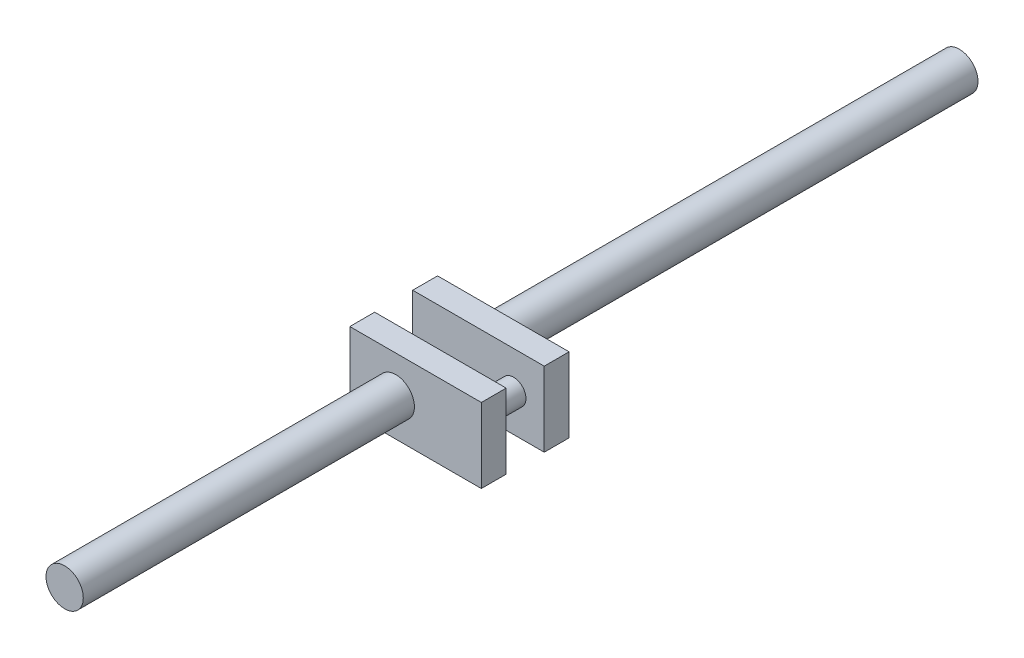
ISO-10303-21;
HEADER;
FILE_DESCRIPTION(('STEP AP214'),'2;1');
FILE_NAME('part.step','',(''),(''),'','','');
FILE_SCHEMA(('AUTOMOTIVE_DESIGN { 1 0 10303 214 1 1 1 1 }'));
ENDSEC;
DATA;
#1=APPLICATION_CONTEXT('core data for automotive mechanical design processes');
#2=APPLICATION_PROTOCOL_DEFINITION('international standard','automotive_design',2000,#1);
#3=PRODUCT_CONTEXT('',#1,'mechanical');
#4=PRODUCT('Part','Part','',(#3));
#5=PRODUCT_RELATED_PRODUCT_CATEGORY('part','',(#4));
#6=PRODUCT_DEFINITION_FORMATION('','',#4);
#7=PRODUCT_DEFINITION_CONTEXT('part definition',#1,'design');
#8=PRODUCT_DEFINITION('design','',#6,#7);
#9=PRODUCT_DEFINITION_SHAPE('','',#8);
#10=(LENGTH_UNIT() NAMED_UNIT(*) SI_UNIT(.MILLI.,.METRE.));
#11=(NAMED_UNIT(*) PLANE_ANGLE_UNIT() SI_UNIT($,.RADIAN.));
#12=(NAMED_UNIT(*) SI_UNIT($,.STERADIAN.) SOLID_ANGLE_UNIT());
#13=UNCERTAINTY_MEASURE_WITH_UNIT(LENGTH_MEASURE(1.E-05),#10,'distance_accuracy_value','');
#14=(GEOMETRIC_REPRESENTATION_CONTEXT(3) GLOBAL_UNCERTAINTY_ASSIGNED_CONTEXT((#13)) GLOBAL_UNIT_ASSIGNED_CONTEXT((#10,
#11,#12)) REPRESENTATION_CONTEXT('',''));
#15=CARTESIAN_POINT('',(0.,0.,0.));
#16=DIRECTION('',(0.,0.,1.));
#17=DIRECTION('',(1.,0.,0.));
#18=AXIS2_PLACEMENT_3D('',#15,#16,#17);
#19=CARTESIAN_POINT('',(22.0784487209815,0.,46.4578179555906));
#20=DIRECTION('',(0.,0.,-1.));
#21=DIRECTION('',(-1.,0.,0.));
#22=AXIS2_PLACEMENT_3D('',#19,#20,#21);
#23=CYLINDRICAL_SURFACE('',#22,5.);
#24=CARTESIAN_POINT('',(22.0784487209815,0.,21.4578179555906));
#25=DIRECTION('',(0.,0.,-1.));
#26=DIRECTION('',(-1.,0.,0.));
#27=AXIS2_PLACEMENT_3D('',#24,#25,#26);
#28=CIRCLE('',#27,5.);
#29=CARTESIAN_POINT('',(17.0784487209815,0.,21.4578179555906));
#30=VERTEX_POINT('',#29);
#31=EDGE_CURVE('E53',#30,#30,#28,.F.);
#32=ORIENTED_EDGE('',*,*,#31,.T.);
#33=EDGE_LOOP('',(#32));
#34=FACE_BOUND('',#33,.T.);
#35=CARTESIAN_POINT('',(22.0784487209815,0.,36.7628049111488));
#36=DIRECTION('',(0.,0.,1.));
#37=DIRECTION('',(1.,0.,0.));
#38=AXIS2_PLACEMENT_3D('',#35,#36,#37);
#39=CIRCLE('',#38,5.);
#40=CARTESIAN_POINT('',(27.0784487209815,0.,36.7628049111488));
#41=VERTEX_POINT('',#40);
#42=EDGE_CURVE('E11',#41,#41,#39,.T.);
#43=ORIENTED_EDGE('',*,*,#42,.F.);
#44=EDGE_LOOP('',(#43));
#45=FACE_BOUND('',#44,.T.);
#46=ADVANCED_FACE('F43',(#34,#45),#23,.T.);
#47=CARTESIAN_POINT('',(-18.4915133638617,15.,21.4578179555906));
#48=DIRECTION('',(0.,0.,-1.));
#49=DIRECTION('',(-1.,0.,0.));
#50=AXIS2_PLACEMENT_3D('',#47,#48,#49);
#51=PLANE('',#50);
#52=ORIENTED_EDGE('',*,*,#31,.F.);
#53=EDGE_LOOP('',(#52));
#54=FACE_BOUND('',#53,.T.);
#55=DIRECTION('',(1.,0.,0.));
#56=VECTOR('',#55,1.);
#57=CARTESIAN_POINT('',(-18.4915133638617,-15.,21.4578179555906));
#58=LINE('',#57,#56);
#59=CARTESIAN_POINT('',(-18.4915133638617,-15.,21.4578179555906));
#60=VERTEX_POINT('',#59);
#61=CARTESIAN_POINT('',(34.4268925602896,-15.,21.4578179555906));
#62=VERTEX_POINT('',#61);
#63=EDGE_CURVE('E178',#60,#62,#58,.T.);
#64=ORIENTED_EDGE('',*,*,#63,.T.);
#65=DIRECTION('',(0.,-1.,0.));
#66=VECTOR('',#65,1.);
#67=CARTESIAN_POINT('',(34.4268925602896,15.,21.4578179555906));
#68=LINE('',#67,#66);
#69=CARTESIAN_POINT('',(34.4268925602896,15.,21.4578179555906));
#70=VERTEX_POINT('',#69);
#71=EDGE_CURVE('E213',#70,#62,#68,.T.);
#72=ORIENTED_EDGE('',*,*,#71,.F.);
#73=DIRECTION('',(1.,0.,0.));
#74=VECTOR('',#73,1.);
#75=CARTESIAN_POINT('',(-18.4915133638617,15.,21.4578179555906));
#76=LINE('',#75,#74);
#77=CARTESIAN_POINT('',(-18.4915133638617,15.,21.4578179555906));
#78=VERTEX_POINT('',#77);
#79=EDGE_CURVE('E87',#78,#70,#76,.T.);
#80=ORIENTED_EDGE('',*,*,#79,.F.);
#81=DIRECTION('',(0.,-1.,0.));
#82=VECTOR('',#81,1.);
#83=CARTESIAN_POINT('',(-18.4915133638617,15.,21.4578179555906));
#84=LINE('',#83,#82);
#85=EDGE_CURVE('E61',#78,#60,#84,.T.);
#86=ORIENTED_EDGE('',*,*,#85,.T.);
#87=EDGE_LOOP('',(#64,#72,#80,#86));
#88=FACE_BOUND('',#87,.T.);
#89=ADVANCED_FACE('F229',(#54,#88),#51,.F.);
#90=CARTESIAN_POINT('',(34.4268925602896,15.,11.4578179555906));
#91=DIRECTION('',(1.,0.,0.));
#92=DIRECTION('',(0.,0.,-1.));
#93=AXIS2_PLACEMENT_3D('',#90,#91,#92);
#94=PLANE('',#93);
#95=DIRECTION('',(0.,0.,1.));
#96=VECTOR('',#95,1.);
#97=CARTESIAN_POINT('',(34.4268925602896,-15.,11.4578179555906));
#98=LINE('',#97,#96);
#99=CARTESIAN_POINT('',(34.4268925602896,-15.,11.4578179555906));
#100=VERTEX_POINT('',#99);
#101=EDGE_CURVE('E195',#100,#62,#98,.T.);
#102=ORIENTED_EDGE('',*,*,#101,.F.);
#103=DIRECTION('',(0.,-1.,0.));
#104=VECTOR('',#103,1.);
#105=CARTESIAN_POINT('',(34.4268925602896,15.,11.4578179555906));
#106=LINE('',#105,#104);
#107=CARTESIAN_POINT('',(34.4268925602896,15.,11.4578179555906));
#108=VERTEX_POINT('',#107);
#109=EDGE_CURVE('E210',#108,#100,#106,.T.);
#110=ORIENTED_EDGE('',*,*,#109,.F.);
#111=DIRECTION('',(0.,0.,1.));
#112=VECTOR('',#111,1.);
#113=CARTESIAN_POINT('',(34.4268925602896,15.,11.4578179555906));
#114=LINE('',#113,#112);
#115=EDGE_CURVE('E181',#108,#70,#114,.T.);
#116=ORIENTED_EDGE('',*,*,#115,.T.);
#117=ORIENTED_EDGE('',*,*,#71,.T.);
#118=EDGE_LOOP('',(#102,#110,#116,#117));
#119=FACE_BOUND('',#118,.T.);
#120=ADVANCED_FACE('F231',(#119),#94,.T.);
#121=CARTESIAN_POINT('',(-18.4915133638617,15.,11.4578179555906));
#122=DIRECTION('',(0.,0.,-1.));
#123=DIRECTION('',(-1.,0.,0.));
#124=AXIS2_PLACEMENT_3D('',#121,#122,#123);
#125=PLANE('',#124);
#126=CARTESIAN_POINT('',(0.,0.,11.4578179555906));
#127=DIRECTION('',(0.,0.,-1.));
#128=DIRECTION('',(-1.,0.,0.));
#129=AXIS2_PLACEMENT_3D('',#126,#127,#128);
#130=CIRCLE('',#129,7.5);
#131=CARTESIAN_POINT('',(-7.5,0.,11.4578179555906));
#132=VERTEX_POINT('',#131);
#133=EDGE_CURVE('E216',#132,#132,#130,.T.);
#134=ORIENTED_EDGE('',*,*,#133,.F.);
#135=EDGE_LOOP('',(#134));
#136=FACE_BOUND('',#135,.T.);
#137=DIRECTION('',(1.,0.,0.));
#138=VECTOR('',#137,1.);
#139=CARTESIAN_POINT('',(-18.4915133638617,-15.,11.4578179555906));
#140=LINE('',#139,#138);
#141=CARTESIAN_POINT('',(-18.4915133638617,-15.,11.4578179555906));
#142=VERTEX_POINT('',#141);
#143=EDGE_CURVE('E199',#142,#100,#140,.T.);
#144=ORIENTED_EDGE('',*,*,#143,.F.);
#145=DIRECTION('',(0.,-1.,0.));
#146=VECTOR('',#145,1.);
#147=CARTESIAN_POINT('',(-18.4915133638617,15.,11.4578179555906));
#148=LINE('',#147,#146);
#149=CARTESIAN_POINT('',(-18.4915133638617,15.,11.4578179555906));
#150=VERTEX_POINT('',#149);
#151=EDGE_CURVE('E76',#150,#142,#148,.T.);
#152=ORIENTED_EDGE('',*,*,#151,.F.);
#153=DIRECTION('',(1.,0.,0.));
#154=VECTOR('',#153,1.);
#155=CARTESIAN_POINT('',(-18.4915133638617,15.,11.4578179555906));
#156=LINE('',#155,#154);
#157=EDGE_CURVE('E186',#150,#108,#156,.T.);
#158=ORIENTED_EDGE('',*,*,#157,.T.);
#159=ORIENTED_EDGE('',*,*,#109,.T.);
#160=EDGE_LOOP('',(#144,#152,#158,#159));
#161=FACE_BOUND('',#160,.T.);
#162=ADVANCED_FACE('F240',(#136,#161),#125,.T.);
#163=CARTESIAN_POINT('',(-18.4915133638617,15.,21.4578179555906));
#164=DIRECTION('',(-1.,0.,0.));
#165=DIRECTION('',(0.,0.,1.));
#166=AXIS2_PLACEMENT_3D('',#163,#164,#165);
#167=PLANE('',#166);
#168=DIRECTION('',(0.,0.,-1.));
#169=VECTOR('',#168,1.);
#170=CARTESIAN_POINT('',(-18.4915133638617,-15.,21.4578179555906));
#171=LINE('',#170,#169);
#172=EDGE_CURVE('E182',#60,#142,#171,.T.);
#173=ORIENTED_EDGE('',*,*,#172,.F.);
#174=ORIENTED_EDGE('',*,*,#85,.F.);
#175=DIRECTION('',(0.,0.,-1.));
#176=VECTOR('',#175,1.);
#177=CARTESIAN_POINT('',(-18.4915133638617,15.,21.4578179555906));
#178=LINE('',#177,#176);
#179=EDGE_CURVE('E190',#78,#150,#178,.T.);
#180=ORIENTED_EDGE('',*,*,#179,.T.);
#181=ORIENTED_EDGE('',*,*,#151,.T.);
#182=EDGE_LOOP('',(#173,#174,#180,#181));
#183=FACE_BOUND('',#182,.T.);
#184=ADVANCED_FACE('F241',(#183),#167,.T.);
#185=CARTESIAN_POINT('',(0.,15.,0.));
#186=DIRECTION('',(0.,-1.,0.));
#187=DIRECTION('',(-1.,0.,0.));
#188=AXIS2_PLACEMENT_3D('',#185,#186,#187);
#189=PLANE('',#188);
#190=ORIENTED_EDGE('',*,*,#79,.T.);
#191=ORIENTED_EDGE('',*,*,#115,.F.);
#192=ORIENTED_EDGE('',*,*,#157,.F.);
#193=ORIENTED_EDGE('',*,*,#179,.F.);
#194=EDGE_LOOP('',(#190,#191,#192,#193));
#195=FACE_BOUND('',#194,.T.);
#196=ADVANCED_FACE('F238',(#195),#189,.F.);
#197=CARTESIAN_POINT('',(0.,-15.,0.));
#198=DIRECTION('',(0.,-1.,0.));
#199=DIRECTION('',(-1.,0.,0.));
#200=AXIS2_PLACEMENT_3D('',#197,#198,#199);
#201=PLANE('',#200);
#202=ORIENTED_EDGE('',*,*,#63,.F.);
#203=ORIENTED_EDGE('',*,*,#172,.T.);
#204=ORIENTED_EDGE('',*,*,#143,.T.);
#205=ORIENTED_EDGE('',*,*,#101,.T.);
#206=EDGE_LOOP('',(#202,#203,#204,#205));
#207=FACE_BOUND('',#206,.T.);
#208=ADVANCED_FACE('F235',(#207),#201,.T.);
#209=CARTESIAN_POINT('',(0.,0.,180.));
#210=DIRECTION('',(0.,0.,-1.));
#211=DIRECTION('',(-1.,0.,0.));
#212=AXIS2_PLACEMENT_3D('',#209,#210,#211);
#213=CYLINDRICAL_SURFACE('',#212,7.5);
#214=ORIENTED_EDGE('',*,*,#133,.T.);
#215=EDGE_LOOP('',(#214));
#216=FACE_BOUND('',#215,.T.);
#217=CARTESIAN_POINT('',(0.,0.,-180.));
#218=DIRECTION('',(0.,0.,1.));
#219=DIRECTION('',(1.,0.,0.));
#220=AXIS2_PLACEMENT_3D('',#217,#218,#219);
#221=CIRCLE('',#220,7.5);
#222=CARTESIAN_POINT('',(7.5,0.,-180.));
#223=VERTEX_POINT('',#222);
#224=EDGE_CURVE('E217',#223,#223,#221,.T.);
#225=ORIENTED_EDGE('',*,*,#224,.T.);
#226=EDGE_LOOP('',(#225));
#227=FACE_BOUND('',#226,.T.);
#228=ADVANCED_FACE('F45',(#216,#227),#213,.T.);
#229=CARTESIAN_POINT('',(0.,0.,-180.));
#230=DIRECTION('',(0.,0.,1.));
#231=DIRECTION('',(1.,0.,0.));
#232=AXIS2_PLACEMENT_3D('',#229,#230,#231);
#233=PLANE('',#232);
#234=ORIENTED_EDGE('',*,*,#224,.F.);
#235=EDGE_LOOP('',(#234));
#236=FACE_BOUND('',#235,.T.);
#237=ADVANCED_FACE('F263',(#236),#233,.F.);
#238=CARTESIAN_POINT('',(0.,0.,180.));
#239=DIRECTION('',(0.,0.,-1.));
#240=DIRECTION('',(-1.,0.,0.));
#241=AXIS2_PLACEMENT_3D('',#238,#239,#240);
#242=CYLINDRICAL_SURFACE('',#241,7.5);
#243=CARTESIAN_POINT('',(0.,0.,180.));
#244=DIRECTION('',(0.,0.,1.));
#245=DIRECTION('',(1.,0.,0.));
#246=AXIS2_PLACEMENT_3D('',#243,#244,#245);
#247=CIRCLE('',#246,7.5);
#248=CARTESIAN_POINT('',(7.5,0.,180.));
#249=VERTEX_POINT('',#248);
#250=EDGE_CURVE('E139',#249,#249,#247,.T.);
#251=ORIENTED_EDGE('',*,*,#250,.F.);
#252=EDGE_LOOP('',(#251));
#253=FACE_BOUND('',#252,.T.);
#254=CARTESIAN_POINT('',(0.,0.,46.7628049111489));
#255=DIRECTION('',(0.,0.,-1.));
#256=DIRECTION('',(-1.,0.,0.));
#257=AXIS2_PLACEMENT_3D('',#254,#255,#256);
#258=CIRCLE('',#257,7.5);
#259=CARTESIAN_POINT('',(-7.5,0.,46.7628049111489));
#260=VERTEX_POINT('',#259);
#261=EDGE_CURVE('E174',#260,#260,#258,.T.);
#262=ORIENTED_EDGE('',*,*,#261,.F.);
#263=EDGE_LOOP('',(#262));
#264=FACE_BOUND('',#263,.T.);
#265=ADVANCED_FACE('F257',(#253,#264),#242,.T.);
#266=CARTESIAN_POINT('',(0.,0.,180.));
#267=DIRECTION('',(0.,0.,1.));
#268=DIRECTION('',(1.,0.,0.));
#269=AXIS2_PLACEMENT_3D('',#266,#267,#268);
#270=PLANE('',#269);
#271=ORIENTED_EDGE('',*,*,#250,.T.);
#272=EDGE_LOOP('',(#271));
#273=FACE_BOUND('',#272,.T.);
#274=ADVANCED_FACE('F275',(#273),#270,.T.);
#275=CARTESIAN_POINT('',(-18.4915133638617,15.,46.7628049111489));
#276=DIRECTION('',(0.,0.,-1.));
#277=DIRECTION('',(-1.,0.,0.));
#278=AXIS2_PLACEMENT_3D('',#275,#276,#277);
#279=PLANE('',#278);
#280=ORIENTED_EDGE('',*,*,#261,.T.);
#281=EDGE_LOOP('',(#280));
#282=FACE_BOUND('',#281,.T.);
#283=DIRECTION('',(1.,0.,0.));
#284=VECTOR('',#283,1.);
#285=CARTESIAN_POINT('',(-18.4915133638617,-15.,46.7628049111489));
#286=LINE('',#285,#284);
#287=CARTESIAN_POINT('',(-18.4915133638617,-15.,46.7628049111489));
#288=VERTEX_POINT('',#287);
#289=CARTESIAN_POINT('',(34.4268925602896,-15.,46.7628049111489));
#290=VERTEX_POINT('',#289);
#291=EDGE_CURVE('E134',#288,#290,#286,.T.);
#292=ORIENTED_EDGE('',*,*,#291,.T.);
#293=DIRECTION('',(0.,-1.,0.));
#294=VECTOR('',#293,1.);
#295=CARTESIAN_POINT('',(34.4268925602896,15.,46.7628049111489));
#296=LINE('',#295,#294);
#297=CARTESIAN_POINT('',(34.4268925602896,15.,46.7628049111489));
#298=VERTEX_POINT('',#297);
#299=EDGE_CURVE('E131',#298,#290,#296,.T.);
#300=ORIENTED_EDGE('',*,*,#299,.F.);
#301=DIRECTION('',(1.,0.,0.));
#302=VECTOR('',#301,1.);
#303=CARTESIAN_POINT('',(-18.4915133638617,15.,46.7628049111489));
#304=LINE('',#303,#302);
#305=CARTESIAN_POINT('',(-18.4915133638617,15.,46.7628049111489));
#306=VERTEX_POINT('',#305);
#307=EDGE_CURVE('E117',#306,#298,#304,.T.);
#308=ORIENTED_EDGE('',*,*,#307,.F.);
#309=DIRECTION('',(0.,-1.,0.));
#310=VECTOR('',#309,1.);
#311=CARTESIAN_POINT('',(-18.4915133638617,15.,46.7628049111489));
#312=LINE('',#311,#310);
#313=EDGE_CURVE('E151',#306,#288,#312,.T.);
#314=ORIENTED_EDGE('',*,*,#313,.T.);
#315=EDGE_LOOP('',(#292,#300,#308,#314));
#316=FACE_BOUND('',#315,.T.);
#317=ADVANCED_FACE('F132',(#282,#316),#279,.F.);
#318=CARTESIAN_POINT('',(34.4268925602896,15.,36.7628049111489));
#319=DIRECTION('',(1.,0.,0.));
#320=DIRECTION('',(0.,0.,-1.));
#321=AXIS2_PLACEMENT_3D('',#318,#319,#320);
#322=PLANE('',#321);
#323=DIRECTION('',(0.,0.,1.));
#324=VECTOR('',#323,1.);
#325=CARTESIAN_POINT('',(34.4268925602896,-15.,36.7628049111489));
#326=LINE('',#325,#324);
#327=CARTESIAN_POINT('',(34.4268925602896,-15.,36.7628049111489));
#328=VERTEX_POINT('',#327);
#329=EDGE_CURVE('E154',#328,#290,#326,.T.);
#330=ORIENTED_EDGE('',*,*,#329,.F.);
#331=DIRECTION('',(0.,-1.,0.));
#332=VECTOR('',#331,1.);
#333=CARTESIAN_POINT('',(34.4268925602896,15.,36.7628049111489));
#334=LINE('',#333,#332);
#335=CARTESIAN_POINT('',(34.4268925602896,15.,36.7628049111489));
#336=VERTEX_POINT('',#335);
#337=EDGE_CURVE('E140',#336,#328,#334,.T.);
#338=ORIENTED_EDGE('',*,*,#337,.F.);
#339=DIRECTION('',(0.,0.,1.));
#340=VECTOR('',#339,1.);
#341=CARTESIAN_POINT('',(34.4268925602896,15.,36.7628049111489));
#342=LINE('',#341,#340);
#343=EDGE_CURVE('E122',#336,#298,#342,.T.);
#344=ORIENTED_EDGE('',*,*,#343,.T.);
#345=ORIENTED_EDGE('',*,*,#299,.T.);
#346=EDGE_LOOP('',(#330,#338,#344,#345));
#347=FACE_BOUND('',#346,.T.);
#348=ADVANCED_FACE('F142',(#347),#322,.T.);
#349=CARTESIAN_POINT('',(-18.4915133638617,15.,46.7628049111489));
#350=DIRECTION('',(-1.,0.,0.));
#351=DIRECTION('',(0.,0.,1.));
#352=AXIS2_PLACEMENT_3D('',#349,#350,#351);
#353=PLANE('',#352);
#354=DIRECTION('',(0.,0.,-1.));
#355=VECTOR('',#354,1.);
#356=CARTESIAN_POINT('',(-18.4915133638617,-15.,46.7628049111489));
#357=LINE('',#356,#355);
#358=CARTESIAN_POINT('',(-18.4915133638617,-15.,36.7628049111489));
#359=VERTEX_POINT('',#358);
#360=EDGE_CURVE('E128',#288,#359,#357,.T.);
#361=ORIENTED_EDGE('',*,*,#360,.F.);
#362=ORIENTED_EDGE('',*,*,#313,.F.);
#363=DIRECTION('',(0.,0.,-1.));
#364=VECTOR('',#363,1.);
#365=CARTESIAN_POINT('',(-18.4915133638617,15.,46.7628049111489));
#366=LINE('',#365,#364);
#367=CARTESIAN_POINT('',(-18.4915133638617,15.,36.7628049111489));
#368=VERTEX_POINT('',#367);
#369=EDGE_CURVE('E125',#306,#368,#366,.T.);
#370=ORIENTED_EDGE('',*,*,#369,.T.);
#371=DIRECTION('',(0.,-1.,0.));
#372=VECTOR('',#371,1.);
#373=CARTESIAN_POINT('',(-18.4915133638617,15.,36.7628049111489));
#374=LINE('',#373,#372);
#375=EDGE_CURVE('E166',#368,#359,#374,.T.);
#376=ORIENTED_EDGE('',*,*,#375,.T.);
#377=EDGE_LOOP('',(#361,#362,#370,#376));
#378=FACE_BOUND('',#377,.T.);
#379=ADVANCED_FACE('F355',(#378),#353,.T.);
#380=CARTESIAN_POINT('',(0.,15.,0.));
#381=DIRECTION('',(0.,-1.,0.));
#382=DIRECTION('',(-1.,0.,0.));
#383=AXIS2_PLACEMENT_3D('',#380,#381,#382);
#384=PLANE('',#383);
#385=ORIENTED_EDGE('',*,*,#307,.T.);
#386=ORIENTED_EDGE('',*,*,#343,.F.);
#387=DIRECTION('',(1.,0.,0.));
#388=VECTOR('',#387,1.);
#389=CARTESIAN_POINT('',(-18.4915133638617,15.,36.7628049111489));
#390=LINE('',#389,#388);
#391=EDGE_CURVE('E144',#368,#336,#390,.T.);
#392=ORIENTED_EDGE('',*,*,#391,.F.);
#393=ORIENTED_EDGE('',*,*,#369,.F.);
#394=EDGE_LOOP('',(#385,#386,#392,#393));
#395=FACE_BOUND('',#394,.T.);
#396=ADVANCED_FACE('F119',(#395),#384,.F.);
#397=CARTESIAN_POINT('',(0.,-15.,0.));
#398=DIRECTION('',(0.,-1.,0.));
#399=DIRECTION('',(-1.,0.,0.));
#400=AXIS2_PLACEMENT_3D('',#397,#398,#399);
#401=PLANE('',#400);
#402=ORIENTED_EDGE('',*,*,#291,.F.);
#403=ORIENTED_EDGE('',*,*,#360,.T.);
#404=DIRECTION('',(1.,0.,0.));
#405=VECTOR('',#404,1.);
#406=CARTESIAN_POINT('',(-18.4915133638617,-15.,36.7628049111489));
#407=LINE('',#406,#405);
#408=EDGE_CURVE('E157',#359,#328,#407,.T.);
#409=ORIENTED_EDGE('',*,*,#408,.T.);
#410=ORIENTED_EDGE('',*,*,#329,.T.);
#411=EDGE_LOOP('',(#402,#403,#409,#410));
#412=FACE_BOUND('',#411,.T.);
#413=ADVANCED_FACE('F373',(#412),#401,.T.);
#414=CARTESIAN_POINT('',(0.,-20.,36.7628049111488));
#415=DIRECTION('',(0.,0.,1.));
#416=DIRECTION('',(1.,0.,0.));
#417=AXIS2_PLACEMENT_3D('',#414,#415,#416);
#418=PLANE('',#417);
#419=ORIENTED_EDGE('',*,*,#42,.T.);
#420=EDGE_LOOP('',(#419));
#421=FACE_BOUND('',#420,.T.);
#422=ORIENTED_EDGE('',*,*,#408,.F.);
#423=ORIENTED_EDGE('',*,*,#375,.F.);
#424=ORIENTED_EDGE('',*,*,#391,.T.);
#425=ORIENTED_EDGE('',*,*,#337,.T.);
#426=EDGE_LOOP('',(#422,#423,#424,#425));
#427=FACE_BOUND('',#426,.T.);
#428=ADVANCED_FACE('F382',(#421,#427),#418,.F.);
#429=CLOSED_SHELL('',(#46,#89,#120,#162,#184,#196,#208,#228,#237,#265,#274,#317,#348,#379,#396,
#413,#428));
#430=MANIFOLD_SOLID_BREP('B2',#429);
#431=ADVANCED_BREP_SHAPE_REPRESENTATION('',(#18,#430),#14);
#432=SHAPE_DEFINITION_REPRESENTATION(#9,#431);
ENDSEC;
END-ISO-10303-21;
